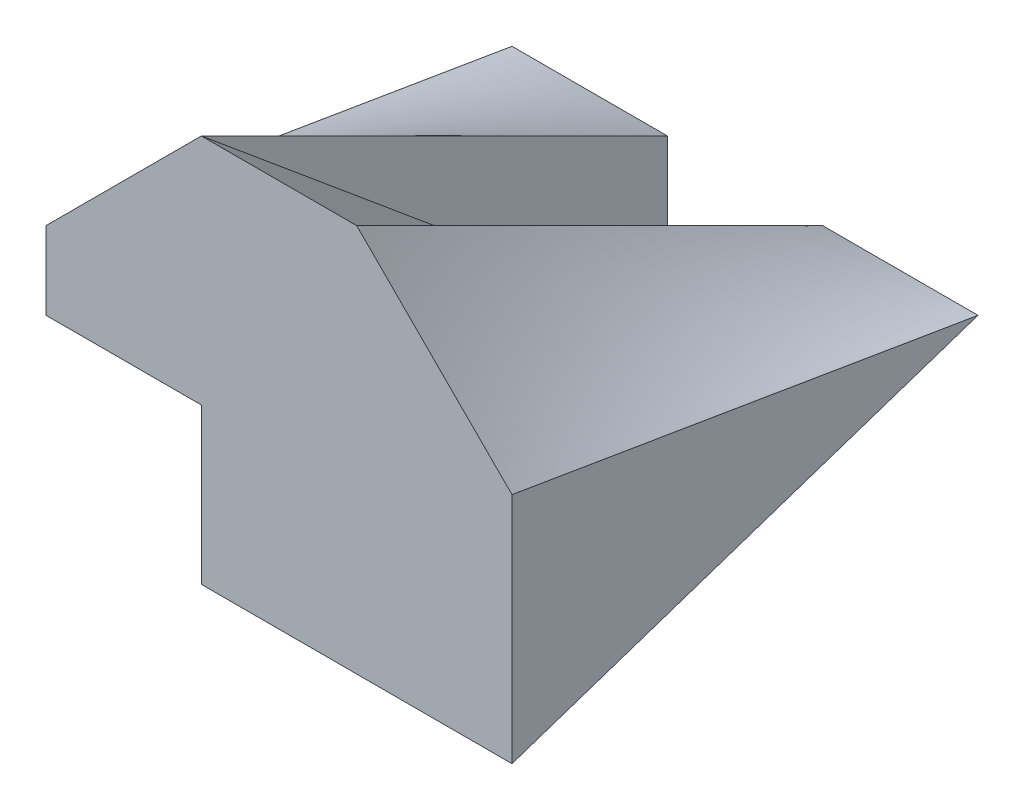
ISO-10303-21;
HEADER;
FILE_DESCRIPTION(('STEP AP214'),'2;1');
FILE_NAME('part.step','',(''),(''),'','','');
FILE_SCHEMA(('AUTOMOTIVE_DESIGN { 1 0 10303 214 1 1 1 1 }'));
ENDSEC;
DATA;
#1=APPLICATION_CONTEXT('core data for automotive mechanical design processes');
#2=APPLICATION_PROTOCOL_DEFINITION('international standard','automotive_design',2000,#1);
#3=PRODUCT_CONTEXT('',#1,'mechanical');
#4=PRODUCT('Part','Part','',(#3));
#5=PRODUCT_RELATED_PRODUCT_CATEGORY('part','',(#4));
#6=PRODUCT_DEFINITION_FORMATION('','',#4);
#7=PRODUCT_DEFINITION_CONTEXT('part definition',#1,'design');
#8=PRODUCT_DEFINITION('design','',#6,#7);
#9=PRODUCT_DEFINITION_SHAPE('','',#8);
#10=(LENGTH_UNIT() NAMED_UNIT(*) SI_UNIT(.MILLI.,.METRE.));
#11=(NAMED_UNIT(*) PLANE_ANGLE_UNIT() SI_UNIT($,.RADIAN.));
#12=(NAMED_UNIT(*) SI_UNIT($,.STERADIAN.) SOLID_ANGLE_UNIT());
#13=UNCERTAINTY_MEASURE_WITH_UNIT(LENGTH_MEASURE(1.E-05),#10,'distance_accuracy_value','');
#14=(GEOMETRIC_REPRESENTATION_CONTEXT(3) GLOBAL_UNCERTAINTY_ASSIGNED_CONTEXT((#13)) GLOBAL_UNIT_ASSIGNED_CONTEXT((#10,
#11,#12)) REPRESENTATION_CONTEXT('',''));
#15=CARTESIAN_POINT('',(0.,0.,0.));
#16=DIRECTION('',(0.,0.,1.));
#17=DIRECTION('',(1.,0.,0.));
#18=AXIS2_PLACEMENT_3D('',#15,#16,#17);
#19=CARTESIAN_POINT('',(-3.,5.,-3.));
#20=DIRECTION('',(0.,0.,1.));
#21=DIRECTION('',(1.,0.,0.));
#22=AXIS2_PLACEMENT_3D('',#19,#20,#21);
#23=PLANE('',#22);
#24=CARTESIAN_POINT('',(-1.00025718760605,2.00051437410323,-3.00017145803441));
#25=CARTESIAN_POINT('',(-1.08348746753826,2.00022843422317,-3.00007614474106));
#26=CARTESIAN_POINT('',(-1.16671802453137,2.00002631512141,-3.00000877170714));
#27=CARTESIAN_POINT('',(-1.33325236647565,1.99976841387656,-2.99992280462552));
#28=CARTESIAN_POINT('',(-1.41655615165392,1.99971276018365,-2.99990425339455));
#29=CARTESIAN_POINT('',(-1.58322363144191,1.99972691737059,-2.99990897245686));
#30=CARTESIAN_POINT('',(-1.66658732602528,1.99979681856452,-2.99993227285484));
#31=CARTESIAN_POINT('',(-1.83334855773055,2.00000706533031,-3.0000023551101));
#32=CARTESIAN_POINT('',(-1.91674609480355,2.00014743958974,-3.00004914652991));
#33=CARTESIAN_POINT('',(-2.08353960787812,2.00042709380074,-3.00014236460024));
#34=CARTESIAN_POINT('',(-2.1669355838796,2.00056637377279,-3.0001887912576));
#35=CARTESIAN_POINT('',(-2.33368472786421,2.00076007999825,-3.00025335999942));
#36=CARTESIAN_POINT('',(-2.41703789577916,2.00081454990578,-3.00027151663526));
#37=CARTESIAN_POINT('',(-2.58365802158182,2.00074979852258,-3.00024993284086));
#38=CARTESIAN_POINT('',(-2.66692497943817,2.00063075688107,-3.00021025229369));
#39=CARTESIAN_POINT('',(-2.83333057144586,2.00013557237079,-3.00004519079026));
#40=CARTESIAN_POINT('',(-2.91646920697255,1.99975982322761,-2.99991994107587));
#41=CARTESIAN_POINT('',(-2.99960693144676,1.99921386289352,-2.99973795429784));
#42=B_SPLINE_CURVE_WITH_KNOTS('',3,(#24,#25,#26,#27,#28,#29,#30,#31,#32,#33,#34,#35,#36,#37,#38,
#39,#40,#41),.UNSPECIFIED.,.F.,.F.,(4,2,2,2,2,2,2,2,4),(0.,0.249692370269716,0.499603647921515,
0.749694763655928,0.999887767050963,1.25007607279664,1.50013555695398,1.74993632005913,
1.99935480840494),.UNSPECIFIED.);
#43=CARTESIAN_POINT('',(-3.,1.99958333947141,-3.));
#44=VERTEX_POINT('',#43);
#45=CARTESIAN_POINT('',(-1.00000159575691,2.00035876601939,-3.00000106383679));
#46=VERTEX_POINT('',#45);
#47=EDGE_CURVE('E141',#44,#46,#42,.F.);
#48=ORIENTED_EDGE('',*,*,#47,.T.);
#49=DIRECTION('',(0.,1.,0.));
#50=VECTOR('',#49,1.);
#51=CARTESIAN_POINT('',(-1.,0.,-3.));
#52=LINE('',#51,#50);
#53=CARTESIAN_POINT('',(-1.,0.,-3.));
#54=VERTEX_POINT('',#53);
#55=EDGE_CURVE('E129',#54,#46,#52,.T.);
#56=ORIENTED_EDGE('',*,*,#55,.F.);
#57=DIRECTION('',(-1.,0.,0.));
#58=VECTOR('',#57,1.);
#59=CARTESIAN_POINT('',(-1.,0.,-3.));
#60=LINE('',#59,#58);
#61=CARTESIAN_POINT('',(-3.,0.,-3.));
#62=VERTEX_POINT('',#61);
#63=EDGE_CURVE('E140',#54,#62,#60,.T.);
#64=ORIENTED_EDGE('',*,*,#63,.T.);
#65=DIRECTION('',(0.,-1.,0.));
#66=VECTOR('',#65,1.);
#67=CARTESIAN_POINT('',(-3.,5.,-3.));
#68=LINE('',#67,#66);
#69=EDGE_CURVE('E45',#44,#62,#68,.T.);
#70=ORIENTED_EDGE('',*,*,#69,.F.);
#71=EDGE_LOOP('',(#48,#56,#64,#70));
#72=FACE_BOUND('',#71,.T.);
#73=ADVANCED_FACE('F33',(#72),#23,.F.);
#74=CARTESIAN_POINT('',(0.,0.,0.));
#75=DIRECTION('',(0.,-1.,0.));
#76=DIRECTION('',(0.,0.,-1.));
#77=AXIS2_PLACEMENT_3D('',#74,#75,#76);
#78=PLANE('',#77);
#79=DIRECTION('',(-1.,0.,0.));
#80=VECTOR('',#79,1.);
#81=CARTESIAN_POINT('',(-3.,0.,-3.));
#82=LINE('',#81,#80);
#83=CARTESIAN_POINT('',(1.,0.,-3.));
#84=VERTEX_POINT('',#83);
#85=EDGE_CURVE('E115',#84,#54,#82,.T.);
#86=ORIENTED_EDGE('',*,*,#85,.F.);
#87=DIRECTION('',(0.,0.,-1.));
#88=VECTOR('',#87,1.);
#89=CARTESIAN_POINT('',(1.,0.,0.));
#90=LINE('',#89,#88);
#91=CARTESIAN_POINT('',(1.,0.,3.));
#92=VERTEX_POINT('',#91);
#93=EDGE_CURVE('E385',#92,#84,#90,.T.);
#94=ORIENTED_EDGE('',*,*,#93,.F.);
#95=DIRECTION('',(1.,0.,0.));
#96=VECTOR('',#95,1.);
#97=CARTESIAN_POINT('',(-3.,0.,3.));
#98=LINE('',#97,#96);
#99=CARTESIAN_POINT('',(-1.,0.,3.));
#100=VERTEX_POINT('',#99);
#101=EDGE_CURVE('E123',#100,#92,#98,.T.);
#102=ORIENTED_EDGE('',*,*,#101,.F.);
#103=DIRECTION('',(0.,0.,1.));
#104=VECTOR('',#103,1.);
#105=CARTESIAN_POINT('',(-1.,0.,-3.));
#106=LINE('',#105,#104);
#107=EDGE_CURVE('E149',#54,#100,#106,.T.);
#108=ORIENTED_EDGE('',*,*,#107,.F.);
#109=EDGE_LOOP('',(#86,#94,#102,#108));
#110=FACE_BOUND('',#109,.T.);
#111=ADVANCED_FACE('F163',(#110),#78,.T.);
#112=CARTESIAN_POINT('',(3.,5.,3.));
#113=DIRECTION('',(-1.,0.,0.));
#114=DIRECTION('',(0.,0.,1.));
#115=AXIS2_PLACEMENT_3D('',#112,#113,#114);
#116=PLANE('',#115);
#117=DIRECTION('',(0.,-1.,0.));
#118=VECTOR('',#117,1.);
#119=CARTESIAN_POINT('',(3.,5.,3.));
#120=LINE('',#119,#118);
#121=CARTESIAN_POINT('',(3.,3.,2.99830700851219));
#122=VERTEX_POINT('',#121);
#123=CARTESIAN_POINT('',(3.,0.,3.));
#124=VERTEX_POINT('',#123);
#125=EDGE_CURVE('E171',#122,#124,#120,.T.);
#126=ORIENTED_EDGE('',*,*,#125,.T.);
#127=DIRECTION('',(0.,-0.316168472331395,0.948703060553528));
#128=VECTOR('',#127,1.);
#129=CARTESIAN_POINT('',(3.,0.899849992053985,0.299887508689105));
#130=LINE('',#129,#128);
#131=CARTESIAN_POINT('',(3.,1.99958333947141,-3.));
#132=VERTEX_POINT('',#131);
#133=EDGE_CURVE('E374',#132,#124,#130,.T.);
#134=ORIENTED_EDGE('',*,*,#133,.F.);
#135=CARTESIAN_POINT('',(3.00018324473397,3.00036648946795,2.99987783684402));
#136=CARTESIAN_POINT('',(3.00010269882627,2.95853623583702,2.74991656322273));
#137=CARTESIAN_POINT('',(3.00008305110513,2.91683106695249,2.49993442105001));
#138=CARTESIAN_POINT('',(3.00007741517827,2.8334880482388,1.99994769717479));
#139=CARTESIAN_POINT('',(3.00009142844077,2.79185020142536,1.74994311496913));
#140=CARTESIAN_POINT('',(3.0000649698055,2.70846427533068,1.24996270111446));
#141=CARTESIAN_POINT('',(3.00002450010485,2.66671620056235,0.999986868712621));
#142=CARTESIAN_POINT('',(2.9999411288771,2.58321519573054,0.500036875273249));
#143=CARTESIAN_POINT('',(2.99989822735808,2.54146226568364,0.250062714232923));
#144=CARTESIAN_POINT('',(2.99986124533515,2.45805442093151,-0.249915915322816));
#145=CARTESIAN_POINT('',(2.99986716747805,2.41639951166256,-0.499920384746598));
#146=CARTESIAN_POINT('',(2.99993708685373,2.33320651663684,-0.999964000326146));
#147=CARTESIAN_POINT('',(3.00000108754375,2.29166843798231,-1.25000314766025));
#148=CARTESIAN_POINT('',(3.00012273970338,2.20858074451546,-1.75007023581674));
#149=CARTESIAN_POINT('',(3.00018039140575,2.16703113018205,-2.00009817671382));
#150=CARTESIAN_POINT('',(3.00009382908969,2.08352816587877,-2.50001950653007));
#151=CARTESIAN_POINT('',(2.9999496676531,2.04157492390104,-2.74991291353306));
#152=CARTESIAN_POINT('',(2.99960693144676,1.99921386289353,-2.99973795429784));
#153=B_SPLINE_CURVE_WITH_KNOTS('',3,(#135,#136,#137,#138,#139,#140,#141,#142,#143,#144,#145,
#146,#147,#148,#149,#150,#151,#152),.UNSPECIFIED.,.F.,.F.,(4,2,2,2,2,2,2,2,4),(0.,
0.760311483543185,1.52065613095589,2.28097011696252,3.04128157883861,3.80163425843404,
4.56203220248473,5.32240226088763,6.08257424390365),.UNSPECIFIED.);
#154=EDGE_CURVE('E231',#122,#132,#153,.T.);
#155=ORIENTED_EDGE('',*,*,#154,.F.);
#156=EDGE_LOOP('',(#126,#134,#155));
#157=FACE_BOUND('',#156,.T.);
#158=ADVANCED_FACE('F35',(#157),#116,.F.);
#159=CARTESIAN_POINT('',(-3.,5.,3.));
#160=DIRECTION('',(1.,0.,0.));
#161=DIRECTION('',(0.,0.,-1.));
#162=AXIS2_PLACEMENT_3D('',#159,#160,#161);
#163=PLANE('',#162);
#164=DIRECTION('',(0.,-1.,0.));
#165=VECTOR('',#164,1.);
#166=CARTESIAN_POINT('',(-3.,5.,3.));
#167=LINE('',#166,#165);
#168=CARTESIAN_POINT('',(-3.,3.,2.9983070085122));
#169=VERTEX_POINT('',#168);
#170=CARTESIAN_POINT('',(-3.,2.,3.));
#171=VERTEX_POINT('',#170);
#172=EDGE_CURVE('E174',#169,#171,#167,.T.);
#173=ORIENTED_EDGE('',*,*,#172,.F.);
#174=CARTESIAN_POINT('',(-2.99960693144676,1.99921386289352,-2.99973795429784));
#175=CARTESIAN_POINT('',(-2.9999496676531,2.04157492390104,-2.74991291353306));
#176=CARTESIAN_POINT('',(-3.00009382908969,2.08352816587878,-2.50001950653007));
#177=CARTESIAN_POINT('',(-3.00018039140575,2.16703113018205,-2.00009817671382));
#178=CARTESIAN_POINT('',(-3.00012273970338,2.20858074451546,-1.75007023581674));
#179=CARTESIAN_POINT('',(-3.00000108754375,2.29166843798231,-1.25000314766025));
#180=CARTESIAN_POINT('',(-2.99993708685373,2.33320651663684,-0.999964000326146));
#181=CARTESIAN_POINT('',(-2.99986716747805,2.41639951166256,-0.499920384746599));
#182=CARTESIAN_POINT('',(-2.99986124533515,2.45805442093151,-0.249915915322816));
#183=CARTESIAN_POINT('',(-2.99989822735808,2.54146226568364,0.250062714232923));
#184=CARTESIAN_POINT('',(-2.9999411288771,2.58321519573054,0.500036875273249));
#185=CARTESIAN_POINT('',(-3.00002450010485,2.66671620056235,0.999986868712621));
#186=CARTESIAN_POINT('',(-3.0000649698055,2.70846427533068,1.24996270111446));
#187=CARTESIAN_POINT('',(-3.00009142844077,2.79185020142536,1.74994311496913));
#188=CARTESIAN_POINT('',(-3.00007741517827,2.8334880482388,1.99994769717479));
#189=CARTESIAN_POINT('',(-3.00008305110513,2.9168310669525,2.49993442105001));
#190=CARTESIAN_POINT('',(-3.00010269882627,2.95853623583702,2.74991656322273));
#191=CARTESIAN_POINT('',(-3.00018324473397,3.00036648946794,2.99987783684402));
#192=B_SPLINE_CURVE_WITH_KNOTS('',3,(#174,#175,#176,#177,#178,#179,#180,#181,#182,#183,#184,
#185,#186,#187,#188,#189,#190,#191),.UNSPECIFIED.,.F.,.F.,(4,2,2,2,2,2,2,2,4),(0.,
0.760171983016021,1.52054204141892,2.28093998546962,3.04129266506504,3.80160412694114,
4.56191811294777,5.32226276036047,6.08257424390365),.UNSPECIFIED.);
#193=EDGE_CURVE('E183',#169,#44,#192,.F.);
#194=ORIENTED_EDGE('',*,*,#193,.T.);
#195=ORIENTED_EDGE('',*,*,#69,.T.);
#196=DIRECTION('',(0.,-0.316227766016838,-0.948683298050514));
#197=VECTOR('',#196,1.);
#198=CARTESIAN_POINT('',(-3.,2.,3.));
#199=LINE('',#198,#197);
#200=EDGE_CURVE('E158',#171,#62,#199,.T.);
#201=ORIENTED_EDGE('',*,*,#200,.F.);
#202=EDGE_LOOP('',(#173,#194,#195,#201));
#203=FACE_BOUND('',#202,.T.);
#204=ADVANCED_FACE('F188',(#203),#163,.F.);
#205=CARTESIAN_POINT('',(-3.,5.,3.));
#206=DIRECTION('',(0.,0.,-1.));
#207=DIRECTION('',(-1.,0.,0.));
#208=AXIS2_PLACEMENT_3D('',#205,#206,#207);
#209=PLANE('',#208);
#210=ORIENTED_EDGE('',*,*,#172,.T.);
#211=DIRECTION('',(-1.,0.,0.));
#212=VECTOR('',#211,1.);
#213=CARTESIAN_POINT('',(-1.,2.,3.));
#214=LINE('',#213,#212);
#215=CARTESIAN_POINT('',(-1.,2.,3.));
#216=VERTEX_POINT('',#215);
#217=EDGE_CURVE('E160',#216,#171,#214,.T.);
#218=ORIENTED_EDGE('',*,*,#217,.F.);
#219=DIRECTION('',(0.,1.,0.));
#220=VECTOR('',#219,1.);
#221=CARTESIAN_POINT('',(-1.,0.,3.));
#222=LINE('',#221,#220);
#223=EDGE_CURVE('E151',#100,#216,#222,.T.);
#224=ORIENTED_EDGE('',*,*,#223,.F.);
#225=ORIENTED_EDGE('',*,*,#101,.T.);
#226=DIRECTION('',(1.,0.,0.));
#227=VECTOR('',#226,1.);
#228=CARTESIAN_POINT('',(1.,0.,3.));
#229=LINE('',#228,#227);
#230=EDGE_CURVE('E381',#92,#124,#229,.T.);
#231=ORIENTED_EDGE('',*,*,#230,.T.);
#232=ORIENTED_EDGE('',*,*,#125,.F.);
#233=CARTESIAN_POINT('',(2.86887290368735,3.1311270963127,2.99999999999999));
#234=CARTESIAN_POINT('',(2.87434226944203,3.12567525001554,2.99999610678721));
#235=CARTESIAN_POINT('',(2.87981194191759,3.12022371151629,2.99999207701469));
#236=CARTESIAN_POINT('',(2.8907517109201,3.1093214825957,2.99998373477427));
#237=CARTESIAN_POINT('',(2.89622180742251,3.10387079214974,2.99997942231728));
#238=CARTESIAN_POINT('',(2.90716243900341,3.09297028844772,2.99997050501086));
#239=CARTESIAN_POINT('',(2.91263297405566,3.08752047516532,2.99996590017311));
#240=CARTESIAN_POINT('',(2.92357449756361,3.07662175542517,2.99995638822472));
#241=CARTESIAN_POINT('',(2.92904548599128,3.0711728489393,2.99995148112654));
#242=CARTESIAN_POINT('',(2.93998793126644,3.06027597282832,2.99994135464561));
#243=CARTESIAN_POINT('',(2.94545938808404,3.0548280031732,2.99993613527617));
#244=CARTESIAN_POINT('',(2.95640278537998,3.04393303119753,2.99992537409389));
#245=CARTESIAN_POINT('',(2.96187472582649,3.03848602884498,2.99991983229523));
#246=CARTESIAN_POINT('',(2.97281910580807,3.02759302234399,2.99990841596621));
#247=CARTESIAN_POINT('',(2.97829154530925,3.02214701816149,2.99990254145095));
#248=CARTESIAN_POINT('',(2.98923693912085,3.01125603937857,2.99989044922235));
#249=CARTESIAN_POINT('',(2.99470989339523,3.00581106474192,2.99988423152508));
#250=CARTESIAN_POINT('',(3.00018324473397,3.00036648946794,2.99987783684402));
#251=B_SPLINE_CURVE_WITH_KNOTS('',3,(#233,#234,#235,#236,#237,#238,#239,#240,#241,#242,#243,
#244,#245,#246,#247,#248,#249,#250),.UNSPECIFIED.,.F.,.F.,(4,2,2,2,2,2,2,2,4),(0.,
0.0231674220478781,0.0463339496992711,0.0694995525407784,0.0926641997424168,0.115827860062711,
0.138990501853936,0.162152093067518,0.185312601259574),.UNSPECIFIED.);
#252=CARTESIAN_POINT('',(2.86887290368734,3.13112709631268,2.99999999999999));
#253=VERTEX_POINT('',#252);
#254=EDGE_CURVE('E264',#122,#253,#251,.F.);
#255=ORIENTED_EDGE('',*,*,#254,.T.);
#256=CARTESIAN_POINT('',(1.82606791231999,4.17393208768375,2.99999999999917));
#257=CARTESIAN_POINT('',(1.86951042896989,4.13046434376353,3.00000560605924));
#258=CARTESIAN_POINT('',(1.91295049327895,4.08699414940394,3.00001230162602));
#259=CARTESIAN_POINT('',(1.9998285556579,4.00004962815408,3.000027070264));
#260=CARTESIAN_POINT('',(2.04326655365401,3.95657530119008,3.00003514336798));
#261=CARTESIAN_POINT('',(2.13014160105702,3.86962500511585,3.00005186529492));
#262=CARTESIAN_POINT('',(2.17357865045356,3.82614903599526,3.00006051412248));
#263=CARTESIAN_POINT('',(2.26045403844473,3.73919988089208,3.00007690681404));
#264=CARTESIAN_POINT('',(2.30389237700429,3.69572669487447,3.00008465069361));
#265=CARTESIAN_POINT('',(2.39077337312767,3.6087891959893,3.00009720686289));
#266=CARTESIAN_POINT('',(2.43421603034535,3.56532488277588,3.00010201930639));
#267=CARTESIAN_POINT('',(2.52110965746891,3.4784130941043,3.00010605520595));
#268=CARTESIAN_POINT('',(2.56456062614062,3.43496561741233,3.00010527921046));
#269=CARTESIAN_POINT('',(2.65147569985351,3.34809721998034,3.00009490670359));
#270=CARTESIAN_POINT('',(2.69493980183202,3.30467629617656,3.00008531155365));
#271=CARTESIAN_POINT('',(2.78188726319859,3.21787295603289,3.00005328461522));
#272=CARTESIAN_POINT('',(2.82537061621075,3.174490533305,3.00003085566316));
#273=CARTESIAN_POINT('',(2.86887290368735,3.1311270963127,2.99999999999999));
#274=B_SPLINE_CURVE_WITH_KNOTS('',3,(#256,#257,#258,#259,#260,#261,#262,#263,#264,#265,#266,
#267,#268,#269,#270,#271,#272,#273),.UNSPECIFIED.,.F.,.F.,(4,2,2,2,2,2,2,2,4),(0.,
0.184364511910799,0.368733412511661,0.553103787149113,0.737470988432463,0.921828517400768,
1.10616795399272,1.29047893848194,1.47474920380884),.UNSPECIFIED.);
#275=CARTESIAN_POINT('',(1.82606791231906,4.17393208768281,2.99999999999958));
#276=VERTEX_POINT('',#275);
#277=EDGE_CURVE('E159',#253,#276,#274,.F.);
#278=ORIENTED_EDGE('',*,*,#277,.T.);
#279=CARTESIAN_POINT('',(1.00005949113411,5.00011898226822,2.99996033924393));
#280=CARTESIAN_POINT('',(1.03447490452427,4.96569266595457,2.99996276211581));
#281=CARTESIAN_POINT('',(1.06889183732422,4.93126786867967,2.99996450977691));
#282=CARTESIAN_POINT('',(1.13772703361002,4.86242093547317,2.99996711798151));
#283=CARTESIAN_POINT('',(1.17214529705728,4.82799879950299,2.99996797854216));
#284=CARTESIAN_POINT('',(1.24098245835149,4.759155800091,2.99996927590167));
#285=CARTESIAN_POINT('',(1.27540135618959,4.72473493664035,2.99996971270446));
#286=CARTESIAN_POINT('',(1.34423910232589,4.65589312524355,2.99997061609568));
#287=CARTESIAN_POINT('',(1.37865795062405,4.62147217729735,2.99997108268413));
#288=CARTESIAN_POINT('',(1.44749497200495,4.55262895677559,2.99997246027099));
#289=CARTESIAN_POINT('',(1.48191314507824,4.51820668419058,2.99997337127359));
#290=CARTESIAN_POINT('',(1.55074829562057,4.44935977904617,2.99997598340739));
#291=CARTESIAN_POINT('',(1.58516527305952,4.41493514645669,2.99997768455195));
#292=CARTESIAN_POINT('',(1.65399762942642,4.34608274411526,2.99998213921296));
#293=CARTESIAN_POINT('',(1.68841300830143,4.31165497431037,2.99998489275293));
#294=CARTESIAN_POINT('',(1.75724203385035,4.24279597023004,2.9999915546488));
#295=CARTESIAN_POINT('',(1.79165568045882,4.20836473588919,2.99999546303377));
#296=CARTESIAN_POINT('',(1.82606791231999,4.17393208768375,2.99999999999917));
#297=B_SPLINE_CURVE_WITH_KNOTS('',3,(#279,#280,#281,#282,#283,#284,#285,#286,#287,#288,#289,
#290,#291,#292,#293,#294,#295,#296),.UNSPECIFIED.,.F.,.F.,(4,2,2,2,2,2,2,2,4),(0.,
0.146035363512903,0.292067903435057,0.438099089575695,0.58413034986414,0.73016298794088,
0.876198096670346,1.02223647092876,1.1682785225363),.UNSPECIFIED.);
#298=CARTESIAN_POINT('',(1.,5.,2.9997027782426));
#299=VERTEX_POINT('',#298);
#300=EDGE_CURVE('E244',#276,#299,#297,.F.);
#301=ORIENTED_EDGE('',*,*,#300,.T.);
#302=CARTESIAN_POINT('',(-1.,5.,2.99980185216175));
#303=DIRECTION('',(1.,0.,0.));
#304=VECTOR('',#303,1.);
#305=LINE('',#302,#304);
#306=CARTESIAN_POINT('',(-1.,5.,2.99970277824262));
#307=VERTEX_POINT('',#306);
#308=EDGE_CURVE('E143',#307,#299,#305,.T.);
#309=ORIENTED_EDGE('',*,*,#308,.F.);
#310=CARTESIAN_POINT('',(-3.00018324473397,3.00036648946794,2.99987783684402));
#311=CARTESIAN_POINT('',(-2.91668061967073,3.08343676321489,2.9999739149143));
#312=CARTESIAN_POINT('',(-2.83326404943614,3.166593366295,3.00003168539308));
#313=CARTESIAN_POINT('',(-2.66650447127178,3.33305373196785,3.00009817705786));
#314=CARTESIAN_POINT('',(-2.5831615119092,3.41635754323696,3.00010687663418));
#315=CARTESIAN_POINT('',(-2.41650656671511,3.58303103185966,3.00010275587227));
#316=CARTESIAN_POINT('',(-2.3331945910437,3.66640071936216,3.00008993102092));
#317=CARTESIAN_POINT('',(-2.16657660855552,3.83315482139672,3.00005968223284));
#318=CARTESIAN_POINT('',(-2.08327060228275,3.91653923647257,3.00004225805437));
#319=CARTESIAN_POINT('',(-1.91665032107433,4.08329419876965,3.00001232892356));
#320=CARTESIAN_POINT('',(-1.83333604651118,4.16666474636308,2.99999982380572));
#321=CARTESIAN_POINT('',(-1.66669586321558,4.33338450061752,2.99998214137042));
#322=CARTESIAN_POINT('',(-1.58336995544432,4.4167337082392,2.99997696362588));
#323=CARTESIAN_POINT('',(-1.41671082189486,4.58341872543706,2.99997121170402));
#324=CARTESIAN_POINT('',(-1.33337759649455,4.66675453539108,2.99997063735875));
#325=CARTESIAN_POINT('',(-1.16671328278232,4.83343042960403,2.99996806391414));
#326=CARTESIAN_POINT('',(-1.08338219451152,4.91677051390406,2.99996606479654));
#327=CARTESIAN_POINT('',(-1.0000594911341,5.00011898226821,2.99996033924393));
#328=B_SPLINE_CURVE_WITH_KNOTS('',3,(#310,#311,#312,#313,#314,#315,#316,#317,#318,#319,#320,
#321,#322,#323,#324,#325,#326,#327),.UNSPECIFIED.,.F.,.F.,(4,2,2,2,2,2,2,2,4),(0.,
0.353355505789504,0.70686660897214,1.06045184355578,1.41405566564415,1.76764759051167,
2.12121890514985,2.47477732040922,2.82834027031396),.UNSPECIFIED.);
#329=EDGE_CURVE('E124',#307,#169,#328,.F.);
#330=ORIENTED_EDGE('',*,*,#329,.T.);
#331=EDGE_LOOP('',(#210,#218,#224,#225,#231,#232,#255,#278,#301,#309,#330));
#332=FACE_BOUND('',#331,.T.);
#333=ADVANCED_FACE('F196',(#332),#209,.F.);
#334=CARTESIAN_POINT('',(-1.,2.,3.));
#335=DIRECTION('',(0.,0.948683298050514,-0.316227766016838));
#336=DIRECTION('',(0.,0.316227766016838,0.948683298050514));
#337=AXIS2_PLACEMENT_3D('',#334,#335,#336);
#338=PLANE('',#337);
#339=ORIENTED_EDGE('',*,*,#200,.T.);
#340=ORIENTED_EDGE('',*,*,#63,.F.);
#341=DIRECTION('',(0.,-0.316227766016838,-0.948683298050514));
#342=VECTOR('',#341,1.);
#343=CARTESIAN_POINT('',(-1.,2.,3.));
#344=LINE('',#343,#342);
#345=EDGE_CURVE('E147',#216,#54,#344,.T.);
#346=ORIENTED_EDGE('',*,*,#345,.F.);
#347=ORIENTED_EDGE('',*,*,#217,.T.);
#348=EDGE_LOOP('',(#339,#340,#346,#347));
#349=FACE_BOUND('',#348,.T.);
#350=ADVANCED_FACE('F156',(#349),#338,.F.);
#351=CARTESIAN_POINT('',(-1.,0.,0.));
#352=DIRECTION('',(1.,0.,0.));
#353=DIRECTION('',(0.,0.,-1.));
#354=AXIS2_PLACEMENT_3D('',#351,#352,#353);
#355=PLANE('',#354);
#356=ORIENTED_EDGE('',*,*,#223,.T.);
#357=ORIENTED_EDGE('',*,*,#345,.T.);
#358=ORIENTED_EDGE('',*,*,#107,.T.);
#359=EDGE_LOOP('',(#356,#357,#358));
#360=FACE_BOUND('',#359,.T.);
#361=ADVANCED_FACE('F148',(#360),#355,.F.);
#362=CARTESIAN_POINT('',(-0.674626906894925,1.94658786879692,-3.10064097849541));
#363=CARTESIAN_POINT('',(-1.26670452781431,1.95795644347871,-3.09225745652971));
#364=CARTESIAN_POINT('',(-1.85855625280855,1.9688732263102,-3.08372333728056));
#365=CARTESIAN_POINT('',(-2.45385175223078,1.98667755799766,-3.07748506765007));
#366=CARTESIAN_POINT('',(-3.0431506535753,1.99248869352971,-3.06724906596778));
#367=CARTESIAN_POINT('',(-3.62687682479794,1.98715436881801,-3.0532979108709));
#368=CARTESIAN_POINT('',(-0.762321734686866,2.61888021690568,-1.88707401789839));
#369=CARTESIAN_POINT('',(-1.30109677442928,2.52364362923352,-1.8431554418147));
#370=CARTESIAN_POINT('',(-1.83909796893018,2.42685935107833,-1.79872096890333));
#371=CARTESIAN_POINT('',(-2.37309590451736,2.32206855509571,-1.75161765671614));
#372=CARTESIAN_POINT('',(-2.90524920411223,2.21358848712845,-1.70328458720075));
#373=CARTESIAN_POINT('',(-3.43406251418319,2.09842844011339,-1.65272485800274));
#374=CARTESIAN_POINT('',(-0.836349954005173,3.26383934806718,-0.664395984985618));
#375=CARTESIAN_POINT('',(-1.33078032721949,3.07991342733881,-0.590914297883179));
#376=CARTESIAN_POINT('',(-1.82161339441479,2.88879289457242,-0.515034406768079));
#377=CARTESIAN_POINT('',(-2.31169331938663,2.69616607735911,-0.438652420837333));
#378=CARTESIAN_POINT('',(-2.79607058657373,2.49213394457632,-0.358468663050098));
#379=CARTESIAN_POINT('',(-3.27643717011453,2.28008044450096,-0.275611116165344));
#380=CARTESIAN_POINT('',(-0.888970346006144,3.86598282459399,0.572553932805403));
#381=CARTESIAN_POINT('',(-1.35205848773847,3.61937244090165,0.666930440895814));
#382=CARTESIAN_POINT('',(-1.81131389567275,3.36509658961322,0.763862104851604));
#383=CARTESIAN_POINT('',(-2.26530508119387,3.10029229349848,0.864303250416159));
#384=CARTESIAN_POINT('',(-2.71573212589125,2.82835971573626,0.967120489863221));
#385=CARTESIAN_POINT('',(-3.16134809924954,2.54680499529584,1.07314511020303));
#386=CARTESIAN_POINT('',(-0.939133280336407,4.4632113857794,1.8111421557102));
#387=CARTESIAN_POINT('',(-1.37462941860249,4.16141699515457,1.92391333277811));
#388=CARTESIAN_POINT('',(-1.80371286734745,3.84679722548749,2.04095963619344));
#389=CARTESIAN_POINT('',(-2.22707449259653,3.52073380882866,2.16182048860602));
#390=CARTESIAN_POINT('',(-2.643617302973,3.18103276242463,2.28722721760034));
#391=CARTESIAN_POINT('',(-3.05356449053511,2.82814047039185,2.4170310284709));
#392=CARTESIAN_POINT('',(-0.981949899971796,5.04574731757506,3.05462792174493));
#393=CARTESIAN_POINT('',(-1.39327605771826,4.69561296591099,3.18351241915926));
#394=CARTESIAN_POINT('',(-1.79855938978187,4.33339296288124,3.31642546702882));
#395=CARTESIAN_POINT('',(-2.19745688359215,3.9584012833448,3.45359574040061));
#396=CARTESIAN_POINT('',(-2.58787195173787,3.56644475247924,3.59642096421544));
#397=CARTESIAN_POINT('',(-2.97117573468929,3.1602656512251,3.74398704482648));
#398=B_SPLINE_SURFACE_WITH_KNOTS('',5,5,((#362,#363,#364,#365,#366,#367),(#368,#369,#370,#371,
#372,#373),(#374,#375,#376,#377,#378,#379),(#380,#381,#382,#383,#384,#385),(#386,#387,#388,#389,
#390,#391),(#392,#393,#394,#395,#396,#397)),.UNSPECIFIED.,.F.,.F.,.F.,(6,6),(6,6),
(-3.24803252857146,3.57301831985763),(-1.2602671504097,1.3976640140574),.UNSPECIFIED.);
#399=CARTESIAN_POINT('',(-1.0000594911341,5.00011898226821,2.99996033924393));
#400=CARTESIAN_POINT('',(-1.00000022084398,4.87500121353093,2.75000139645662));
#401=CARTESIAN_POINT('',(-0.999940694904667,4.74988295343689,2.50004266398534));
#402=CARTESIAN_POINT('',(-0.999856894373344,4.49971693567639,2.0001016976105));
#403=CARTESIAN_POINT('',(-0.999832618453007,4.37466917553079,1.75011946494755));
#404=CARTESIAN_POINT('',(-0.999855070087895,4.12471355130474,1.25010344219932));
#405=CARTESIAN_POINT('',(-0.999901793468472,3.99980567943124,1.00006965600961));
#406=CARTESIAN_POINT('',(-1.0000069285083,3.75001335149583,0.499994369952951));
#407=CARTESIAN_POINT('',(-1.00006534001914,3.62512889515678,0.249952870224226));
#408=CARTESIAN_POINT('',(-1.00013602437541,3.37526855720806,-0.250097666002438));
#409=CARTESIAN_POINT('',(-1.00014829527311,3.25029267196167,-0.500106700684501));
#410=CARTESIAN_POINT('',(-1.00010783397788,3.00021241115944,-1.0000784029112));
#411=CARTESIAN_POINT('',(-1.0000550980534,2.87510802863947,-1.25004106697027));
#412=CARTESIAN_POINT('',(-0.999933269026531,2.62486948309825,-1.74994962259397));
#413=CARTESIAN_POINT('',(-0.999864176025885,2.4997353202671,-1.99989551425327));
#414=CARTESIAN_POINT('',(-0.99989132429074,2.24979765715125,-2.49989753238761));
#415=CARTESIAN_POINT('',(-0.999987536491871,2.12499410260215,-2.74995363175775));
#416=CARTESIAN_POINT('',(-1.00025718705255,2.0005143741051,-3.00017145803503));
#417=B_SPLINE_CURVE_WITH_KNOTS('',3,(#399,#400,#401,#402,#403,#404,#405,#406,#407,#408,#409,
#410,#411,#412,#413,#414,#415,#416),.UNSPECIFIED.,.F.,.F.,(4,2,2,2,2,2,2,2,4),(0.,
0.838573484697402,1.67711536860278,2.51560794945091,3.35408988515294,4.19260721485175,
5.03117267950908,5.86973292767648,6.70814575319509),.UNSPECIFIED.);
#418=EDGE_CURVE('E131',#46,#307,#417,.F.);
#419=ORIENTED_EDGE('',*,*,#193,.F.);
#420=ORIENTED_EDGE('',*,*,#329,.F.);
#421=ORIENTED_EDGE('',*,*,#418,.F.);
#422=ORIENTED_EDGE('',*,*,#47,.F.);
#423=EDGE_LOOP('',(#419,#420,#421,#422));
#424=FACE_BOUND('',#423,.T.);
#425=ADVANCED_FACE('F302',(#424),#398,.F.);
#426=CARTESIAN_POINT('',(3.62687682479794,1.98715436881801,-3.0532979108709));
#427=CARTESIAN_POINT('',(3.0431506535753,1.99248869352971,-3.06724906596777));
#428=CARTESIAN_POINT('',(2.45385175223078,1.98667755799766,-3.07748506765007));
#429=CARTESIAN_POINT('',(1.85855625280855,1.9688732263102,-3.08372333728056));
#430=CARTESIAN_POINT('',(1.26670452781431,1.95795644347871,-3.09225745652971));
#431=CARTESIAN_POINT('',(0.674626906894924,1.94658786879692,-3.10064097849541));
#432=CARTESIAN_POINT('',(3.4340625141832,2.0984284401134,-1.65272485800275));
#433=CARTESIAN_POINT('',(2.90524920411223,2.21358848712845,-1.70328458720074));
#434=CARTESIAN_POINT('',(2.37309590451736,2.3220685550957,-1.75161765671614));
#435=CARTESIAN_POINT('',(1.83909796893019,2.42685935107834,-1.79872096890333));
#436=CARTESIAN_POINT('',(1.30109677442929,2.52364362923353,-1.8431554418147));
#437=CARTESIAN_POINT('',(0.762321734686872,2.61888021690568,-1.88707401789839));
#438=CARTESIAN_POINT('',(3.27643717011452,2.28008044450094,-0.27561111616534));
#439=CARTESIAN_POINT('',(2.79607058657372,2.49213394457632,-0.358468663050096));
#440=CARTESIAN_POINT('',(2.31169331938663,2.69616607735911,-0.43865242083733));
#441=CARTESIAN_POINT('',(1.82161339441478,2.88879289457241,-0.515034406768076));
#442=CARTESIAN_POINT('',(1.33078032721948,3.07991342733879,-0.590914297883176));
#443=CARTESIAN_POINT('',(0.83634995400516,3.26383934806716,-0.664395984985612));
#444=CARTESIAN_POINT('',(3.16134809924956,2.54680499529586,1.07314511020302));
#445=CARTESIAN_POINT('',(2.71573212589126,2.82835971573627,0.967120489863215));
#446=CARTESIAN_POINT('',(2.26530508119387,3.10029229349849,0.864303250416155));
#447=CARTESIAN_POINT('',(1.81131389567276,3.36509658961323,0.7638621048516));
#448=CARTESIAN_POINT('',(1.35205848773848,3.61937244090168,0.666930440895809));
#449=CARTESIAN_POINT('',(0.888970346006165,3.86598282459403,0.572553932805395));
#450=CARTESIAN_POINT('',(3.05356449053509,2.82814047039184,2.41703102847091));
#451=CARTESIAN_POINT('',(2.64361730297299,3.18103276242461,2.28722721760035));
#452=CARTESIAN_POINT('',(2.22707449259651,3.52073380882865,2.16182048860603));
#453=CARTESIAN_POINT('',(1.80371286734743,3.84679722548748,2.04095963619345));
#454=CARTESIAN_POINT('',(1.37462941860247,4.16141699515454,1.92391333277812));
#455=CARTESIAN_POINT('',(0.939133280336391,4.46321138577937,1.81114215571021));
#456=CARTESIAN_POINT('',(2.97117573468929,3.1602656512251,3.74398704482647));
#457=CARTESIAN_POINT('',(2.58787195173787,3.56644475247925,3.59642096421544));
#458=CARTESIAN_POINT('',(2.19745688359216,3.95840128334481,3.45359574040061));
#459=CARTESIAN_POINT('',(1.79855938978188,4.33339296288124,3.31642546702882));
#460=CARTESIAN_POINT('',(1.39327605771826,4.695612965911,3.18351241915926));
#461=CARTESIAN_POINT('',(0.981949899971805,5.04574731757508,3.05462792174492));
#462=B_SPLINE_SURFACE_WITH_KNOTS('',5,5,((#426,#427,#428,#429,#430,#431),(#432,#433,#434,#435,
#436,#437),(#438,#439,#440,#441,#442,#443),(#444,#445,#446,#447,#448,#449),(#450,#451,#452,#453,
#454,#455),(#456,#457,#458,#459,#460,#461)),.UNSPECIFIED.,.F.,.F.,.F.,(6,6),(6,6),
(-3.24803252857146,3.57301831985763),(-1.3976640140574,1.2602671504097),.UNSPECIFIED.);
#463=CARTESIAN_POINT('',(2.99960693144676,1.99921386289352,-2.99973795429784));
#464=CARTESIAN_POINT('',(2.93730605866987,1.99962233437168,-2.99987411145723));
#465=CARTESIAN_POINT('',(2.87500460205882,1.99993593936918,-2.99997864645639));
#466=CARTESIAN_POINT('',(2.75032394944729,2.00040784100555,-3.00013594700185));
#467=CARTESIAN_POINT('',(2.68794475261725,2.00056594504339,-3.00018864834779));
#468=CARTESIAN_POINT('',(2.56312577503868,2.00076052176595,-3.00025350725531));
#469=CARTESIAN_POINT('',(2.50068599412301,2.00079687650812,-3.00026562550271));
#470=CARTESIAN_POINT('',(2.37576401344654,2.00078476354595,-3.00026158784865));
#471=CARTESIAN_POINT('',(2.31328181370261,2.00073623816646,-3.00024541272215));
#472=CARTESIAN_POINT('',(2.18829335937862,2.00059132395752,-3.00019710798584));
#473=CARTESIAN_POINT('',(2.12578710482662,2.00049491665286,-3.00016497221762));
#474=CARTESIAN_POINT('',(2.00076820182129,2.00028976096385,-3.00009658698795));
#475=CARTESIAN_POINT('',(1.93825555337057,2.00018101131311,-3.00006033710437));
#476=CARTESIAN_POINT('',(1.81323996034225,1.99998402281385,-2.99999467427128));
#477=CARTESIAN_POINT('',(1.75073701577123,1.99989578077022,-2.99996526025674));
#478=CARTESIAN_POINT('',(1.62575454624586,1.99976615848641,-2.9999220528288));
#479=CARTESIAN_POINT('',(1.5632750213104,1.999724760662,-2.999908253554));
#480=CARTESIAN_POINT('',(1.50079546717531,1.99971992335288,-2.99990664111763));
#481=B_SPLINE_CURVE_WITH_KNOTS('',3,(#463,#464,#465,#466,#467,#468,#469,#470,#471,#472,#473,
#474,#475,#476,#477,#478,#479,#480),.UNSPECIFIED.,.F.,.F.,(4,2,2,2,2,2,2,2,4),(0.,
0.186906848365439,0.374044906174418,0.561364198419466,0.748810821573636,0.936329827178847,
1.12386809071601,1.31137711597484,1.49881573138096),.UNSPECIFIED.);
#482=CARTESIAN_POINT('',(1.50079532321903,1.99949294649092,-2.99997427504717));
#483=VERTEX_POINT('',#482);
#484=EDGE_CURVE('E390',#132,#483,#481,.T.);
#485=CARTESIAN_POINT('',(1.50079546717531,1.99971992335288,-2.99990664111763));
#486=CARTESIAN_POINT('',(1.47992411706886,1.99971790358092,-2.99990596786031));
#487=CARTESIAN_POINT('',(1.4590527662967,1.9997197427481,-2.99990658091603));
#488=CARTESIAN_POINT('',(1.41731418035059,1.99973165395038,-2.99991055131679));
#489=CARTESIAN_POINT('',(1.39644694517613,1.99974172436302,-2.99991390812101));
#490=CARTESIAN_POINT('',(1.35471683379761,1.99977060883071,-2.9999235362769));
#491=CARTESIAN_POINT('',(1.33385395759218,1.99978942106163,-2.99992980702054));
#492=CARTESIAN_POINT('',(1.29213275081059,1.9998361574368,-2.99994538581227));
#493=CARTESIAN_POINT('',(1.27127442023197,1.99986407959978,-2.99995469319993));
#494=CARTESIAN_POINT('',(1.22956243117185,1.99992929213258,-2.99997643071086));
#495=CARTESIAN_POINT('',(1.20870877268671,1.9999665804099,-2.99998886013663));
#496=CARTESIAN_POINT('',(1.16700619091011,2.00005064979606,-3.00001688326535));
#497=CARTESIAN_POINT('',(1.14615726761384,2.00009742875716,-3.00003247625239));
#498=CARTESIAN_POINT('',(1.10446415279758,2.00020048199447,-3.00006682733149));
#499=CARTESIAN_POINT('',(1.08361996127169,2.00025675412518,-3.00008558470839));
#500=CARTESIAN_POINT('',(1.04193623662703,2.00037861723943,-3.00012620574647));
#501=CARTESIAN_POINT('',(1.02109670350154,2.0004442061511,-3.00014806871703));
#502=CARTESIAN_POINT('',(1.00025718760605,2.00051437410323,-3.00017145803441));
#503=B_SPLINE_CURVE_WITH_KNOTS('',3,(#485,#486,#487,#488,#489,#490,#491,#492,#493,#494,#495,
#496,#497,#498,#499,#500,#501,#502),.UNSPECIFIED.,.F.,.F.,(4,2,2,2,2,2,2,2,4),(0.,
0.0626140506224113,0.125215762395715,0.187804417130457,0.250379468882477,0.31294055308108,
0.375487495472366,0.438020320898771,0.500539261940593),.UNSPECIFIED.);
#504=CARTESIAN_POINT('',(1.,2.0000919969354,-3.));
#505=VERTEX_POINT('',#504);
#506=EDGE_CURVE('E279',#505,#483,#503,.F.);
#507=CARTESIAN_POINT('',(1.00025718705255,2.0005143741051,-3.00017145803503));
#508=CARTESIAN_POINT('',(0.999987536491871,2.12499410260215,-2.74995363175775));
#509=CARTESIAN_POINT('',(0.99989132429074,2.24979765715125,-2.49989753238761));
#510=CARTESIAN_POINT('',(0.999864176025885,2.4997353202671,-1.99989551425327));
#511=CARTESIAN_POINT('',(0.99993326902653,2.62486948309825,-1.74994962259398));
#512=CARTESIAN_POINT('',(1.0000550980534,2.87510802863947,-1.25004106697027));
#513=CARTESIAN_POINT('',(1.00010783397788,3.00021241115944,-1.0000784029112));
#514=CARTESIAN_POINT('',(1.00014829527311,3.25029267196167,-0.500106700684501));
#515=CARTESIAN_POINT('',(1.00013602437541,3.37526855720806,-0.250097666002438));
#516=CARTESIAN_POINT('',(1.00006534001914,3.62512889515678,0.249952870224226));
#517=CARTESIAN_POINT('',(1.0000069285083,3.75001335149583,0.49999436995295));
#518=CARTESIAN_POINT('',(0.999901793468472,3.99980567943124,1.00006965600961));
#519=CARTESIAN_POINT('',(0.999855070087895,4.12471355130474,1.25010344219932));
#520=CARTESIAN_POINT('',(0.999832618453006,4.37466917553079,1.75011946494755));
#521=CARTESIAN_POINT('',(0.999856894373344,4.49971693567639,2.0001016976105));
#522=CARTESIAN_POINT('',(0.999940694904669,4.74988295343689,2.50004266398534));
#523=CARTESIAN_POINT('',(1.00000022084398,4.87500121353094,2.75000139645662));
#524=CARTESIAN_POINT('',(1.00005949113411,5.00011898226822,2.99996033924393));
#525=B_SPLINE_CURVE_WITH_KNOTS('',3,(#507,#508,#509,#510,#511,#512,#513,#514,#515,#516,#517,
#518,#519,#520,#521,#522,#523,#524),.UNSPECIFIED.,.F.,.F.,(4,2,2,2,2,2,2,2,4),(0.,
0.83841282551861,1.67697307368601,2.51553853834333,3.35405586804215,4.19253780374418,
5.03103038459231,5.86957226849768,6.70814575319509),.UNSPECIFIED.);
#526=EDGE_CURVE('E407',#505,#299,#525,.T.);
#527=ORIENTED_EDGE('',*,*,#484,.T.);
#528=ORIENTED_EDGE('',*,*,#506,.F.);
#529=ORIENTED_EDGE('',*,*,#526,.T.);
#530=ORIENTED_EDGE('',*,*,#300,.F.);
#531=ORIENTED_EDGE('',*,*,#277,.F.);
#532=ORIENTED_EDGE('',*,*,#254,.F.);
#533=ORIENTED_EDGE('',*,*,#154,.T.);
#534=EDGE_LOOP('',(#527,#528,#529,#530,#531,#532,#533));
#535=FACE_BOUND('',#534,.T.);
#536=ADVANCED_FACE('F289',(#535),#462,.F.);
#537=CARTESIAN_POINT('',(1.,0.899849992053985,0.299887508689105));
#538=DIRECTION('',(0.,0.948703060553528,0.316168472331395));
#539=DIRECTION('',(0.,-0.316168472331395,0.948703060553528));
#540=AXIS2_PLACEMENT_3D('',#537,#538,#539);
#541=PLANE('',#540);
#542=ORIENTED_EDGE('',*,*,#133,.T.);
#543=ORIENTED_EDGE('',*,*,#230,.F.);
#544=DIRECTION('',(0.,-0.316168472331395,0.948703060553528));
#545=VECTOR('',#544,1.);
#546=CARTESIAN_POINT('',(1.,0.899849992053985,0.299887508689105));
#547=LINE('',#546,#545);
#548=CARTESIAN_POINT('',(1.,1.42837230957513,-1.28600983428692));
#549=VERTEX_POINT('',#548);
#550=EDGE_CURVE('E60',#549,#92,#547,.T.);
#551=ORIENTED_EDGE('',*,*,#550,.F.);
#552=EDGE_CURVE('E378',#505,#549,#547,.T.);
#553=ORIENTED_EDGE('',*,*,#552,.F.);
#554=ORIENTED_EDGE('',*,*,#506,.T.);
#555=ORIENTED_EDGE('',*,*,#484,.F.);
#556=EDGE_LOOP('',(#542,#543,#551,#553,#554,#555));
#557=FACE_BOUND('',#556,.T.);
#558=ADVANCED_FACE('F301',(#557),#541,.F.);
#559=CARTESIAN_POINT('',(1.,0.,0.));
#560=DIRECTION('',(1.,0.,0.));
#561=DIRECTION('',(0.,0.,-1.));
#562=AXIS2_PLACEMENT_3D('',#559,#560,#561);
#563=PLANE('',#562);
#564=DIRECTION('',(0.,-0.640196876985997,-0.76821088165775));
#565=VECTOR('',#564,1.);
#566=CARTESIAN_POINT('',(1.,1.47541862191185,-1.22955612390787));
#567=LINE('',#566,#565);
#568=EDGE_CURVE('E11',#549,#84,#567,.T.);
#569=ORIENTED_EDGE('',*,*,#568,.F.);
#570=ORIENTED_EDGE('',*,*,#550,.T.);
#571=ORIENTED_EDGE('',*,*,#93,.T.);
#572=EDGE_LOOP('',(#569,#570,#571));
#573=FACE_BOUND('',#572,.T.);
#574=ADVANCED_FACE('F430',(#573),#563,.T.);
#575=CARTESIAN_POINT('',(-1.,0.,0.));
#576=DIRECTION('',(-1.,0.,0.));
#577=DIRECTION('',(0.,0.,1.));
#578=AXIS2_PLACEMENT_3D('',#575,#576,#577);
#579=PLANE('',#578);
#580=DIRECTION('',(0.,-0.640196876985997,-0.76821088165775));
#581=VECTOR('',#580,1.);
#582=CARTESIAN_POINT('',(-1.,5.,2.99980185216175));
#583=LINE('',#582,#581);
#584=EDGE_CURVE('E118',#307,#54,#583,.T.);
#585=ORIENTED_EDGE('',*,*,#584,.T.);
#586=ORIENTED_EDGE('',*,*,#55,.T.);
#587=ORIENTED_EDGE('',*,*,#418,.T.);
#588=EDGE_LOOP('',(#585,#586,#587));
#589=FACE_BOUND('',#588,.T.);
#590=ADVANCED_FACE('F128',(#589),#579,.F.);
#591=CARTESIAN_POINT('',(1.,0.,0.));
#592=DIRECTION('',(-1.,0.,0.));
#593=DIRECTION('',(0.,0.,1.));
#594=AXIS2_PLACEMENT_3D('',#591,#592,#593);
#595=PLANE('',#594);
#596=ORIENTED_EDGE('',*,*,#526,.F.);
#597=ORIENTED_EDGE('',*,*,#552,.T.);
#598=DIRECTION('',(0.,-0.640196876985997,-0.76821088165775));
#599=VECTOR('',#598,1.);
#600=CARTESIAN_POINT('',(1.,5.,2.99980185216175));
#601=LINE('',#600,#599);
#602=EDGE_CURVE('E52',#299,#549,#601,.T.);
#603=ORIENTED_EDGE('',*,*,#602,.F.);
#604=EDGE_LOOP('',(#596,#597,#603));
#605=FACE_BOUND('',#604,.T.);
#606=ADVANCED_FACE('F410',(#605),#595,.T.);
#607=CARTESIAN_POINT('',(-1.,5.,2.99980185216175));
#608=DIRECTION('',(0.,-0.76821088165775,0.640196876985997));
#609=DIRECTION('',(0.,-0.640196876985997,-0.76821088165775));
#610=AXIS2_PLACEMENT_3D('',#607,#608,#609);
#611=PLANE('',#610);
#612=ORIENTED_EDGE('',*,*,#602,.T.);
#613=ORIENTED_EDGE('',*,*,#568,.T.);
#614=ORIENTED_EDGE('',*,*,#85,.T.);
#615=ORIENTED_EDGE('',*,*,#584,.F.);
#616=ORIENTED_EDGE('',*,*,#308,.T.);
#617=EDGE_LOOP('',(#612,#613,#614,#615,#616));
#618=FACE_BOUND('',#617,.T.);
#619=ADVANCED_FACE('F117',(#618),#611,.F.);
#620=CLOSED_SHELL('',(#73,#111,#158,#204,#333,#350,#361,#425,#536,#558,#574,#590,#606,#619));
#621=MANIFOLD_SOLID_BREP('B2',#620);
#622=ADVANCED_BREP_SHAPE_REPRESENTATION('',(#18,#621),#14);
#623=SHAPE_DEFINITION_REPRESENTATION(#9,#622);
ENDSEC;
END-ISO-10303-21;
